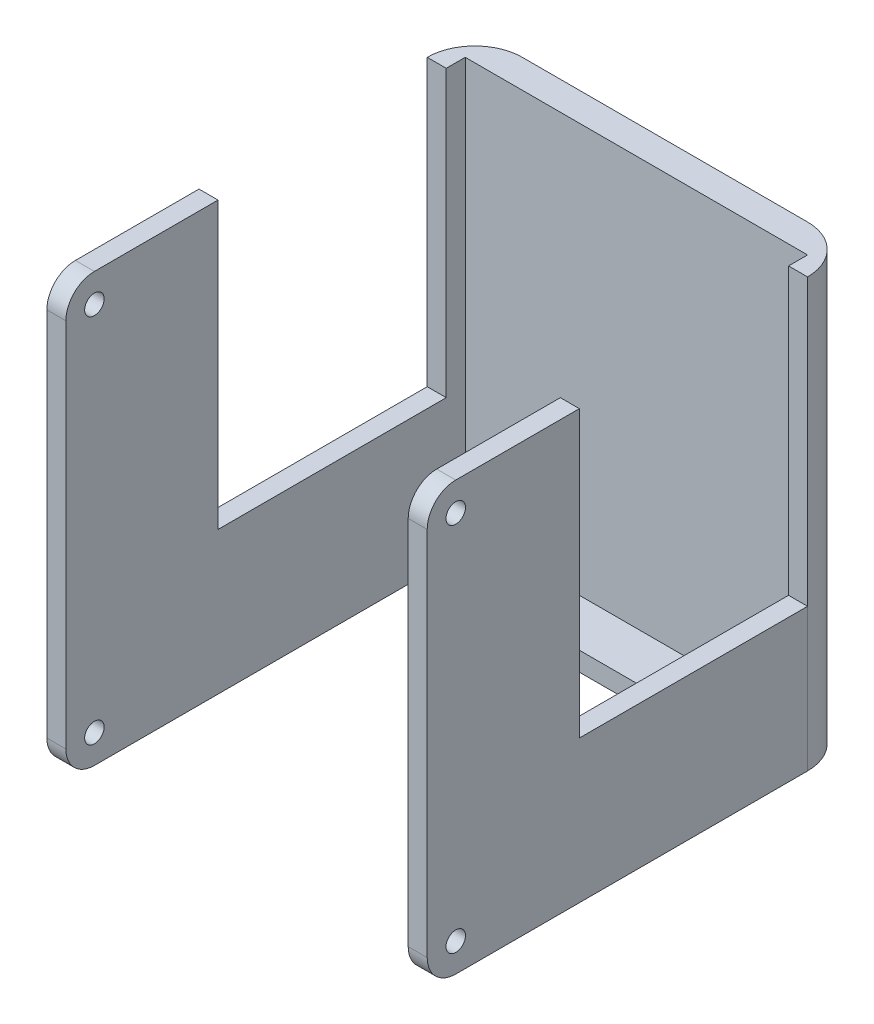
ISO-10303-21;
HEADER;
FILE_DESCRIPTION(('STEP AP214'),'2;1');
FILE_NAME('part.step','',(''),(''),'','','');
FILE_SCHEMA(('AUTOMOTIVE_DESIGN { 1 0 10303 214 1 1 1 1 }'));
ENDSEC;
DATA;
#1=APPLICATION_CONTEXT('core data for automotive mechanical design processes');
#2=APPLICATION_PROTOCOL_DEFINITION('international standard','automotive_design',2000,#1);
#3=PRODUCT_CONTEXT('',#1,'mechanical');
#4=PRODUCT('Part','Part','',(#3));
#5=PRODUCT_RELATED_PRODUCT_CATEGORY('part','',(#4));
#6=PRODUCT_DEFINITION_FORMATION('','',#4);
#7=PRODUCT_DEFINITION_CONTEXT('part definition',#1,'design');
#8=PRODUCT_DEFINITION('design','',#6,#7);
#9=PRODUCT_DEFINITION_SHAPE('','',#8);
#10=(LENGTH_UNIT() NAMED_UNIT(*) SI_UNIT(.MILLI.,.METRE.));
#11=(NAMED_UNIT(*) PLANE_ANGLE_UNIT() SI_UNIT($,.RADIAN.));
#12=(NAMED_UNIT(*) SI_UNIT($,.STERADIAN.) SOLID_ANGLE_UNIT());
#13=UNCERTAINTY_MEASURE_WITH_UNIT(LENGTH_MEASURE(1.E-05),#10,'distance_accuracy_value','');
#14=(GEOMETRIC_REPRESENTATION_CONTEXT(3) GLOBAL_UNCERTAINTY_ASSIGNED_CONTEXT((#13)) GLOBAL_UNIT_ASSIGNED_CONTEXT((#10,
#11,#12)) REPRESENTATION_CONTEXT('',''));
#15=CARTESIAN_POINT('',(0.,0.,0.));
#16=DIRECTION('',(0.,0.,1.));
#17=DIRECTION('',(1.,0.,0.));
#18=AXIS2_PLACEMENT_3D('',#15,#16,#17);
#19=CARTESIAN_POINT('',(-14.5454545454545,16.9090909090909,-5.));
#20=DIRECTION('',(0.,-1.,0.));
#21=DIRECTION('',(0.,0.,-1.));
#22=AXIS2_PLACEMENT_3D('',#19,#20,#21);
#23=PLANE('',#22);
#24=CARTESIAN_POINT('',(-9.54545454545454,16.9090909090909,0.));
#25=DIRECTION('',(0.,-1.,0.));
#26=DIRECTION('',(0.,0.,-1.));
#27=AXIS2_PLACEMENT_3D('',#24,#25,#26);
#28=CIRCLE('',#27,5.);
#29=CARTESIAN_POINT('',(-9.54545454545455,16.9090909090909,-5.));
#30=VERTEX_POINT('',#29);
#31=CARTESIAN_POINT('',(-14.5454545454545,16.9090909090909,0.));
#32=VERTEX_POINT('',#31);
#33=EDGE_CURVE('E238',#30,#32,#28,.F.);
#34=ORIENTED_EDGE('',*,*,#33,.T.);
#35=DIRECTION('',(-1.,0.,0.));
#36=VECTOR('',#35,1.);
#37=CARTESIAN_POINT('',(29.4545454545455,16.9090909090909,0.));
#38=LINE('',#37,#36);
#39=CARTESIAN_POINT('',(-12.5454545454545,16.9090909090909,0.));
#40=VERTEX_POINT('',#39);
#41=EDGE_CURVE('E209',#40,#32,#38,.T.);
#42=ORIENTED_EDGE('',*,*,#41,.F.);
#43=DIRECTION('',(0.,0.,1.));
#44=VECTOR('',#43,1.);
#45=CARTESIAN_POINT('',(-12.5454545454545,16.9090909090909,3.));
#46=LINE('',#45,#44);
#47=CARTESIAN_POINT('',(-12.5454545454545,16.9090909090909,-2.));
#48=VERTEX_POINT('',#47);
#49=EDGE_CURVE('E428',#48,#40,#46,.T.);
#50=ORIENTED_EDGE('',*,*,#49,.F.);
#51=DIRECTION('',(-1.,0.,0.));
#52=VECTOR('',#51,1.);
#53=CARTESIAN_POINT('',(-12.5454545454545,16.9090909090909,-2.));
#54=LINE('',#53,#52);
#55=CARTESIAN_POINT('',(23.4545454545454,16.9090909090909,-2.));
#56=VERTEX_POINT('',#55);
#57=EDGE_CURVE('E369',#56,#48,#54,.T.);
#58=ORIENTED_EDGE('',*,*,#57,.F.);
#59=DIRECTION('',(0.,0.,-1.));
#60=VECTOR('',#59,1.);
#61=CARTESIAN_POINT('',(23.4545454545455,16.9090909090909,3.));
#62=LINE('',#61,#60);
#63=CARTESIAN_POINT('',(23.4545454545455,16.9090909090909,0.));
#64=VERTEX_POINT('',#63);
#65=EDGE_CURVE('E432',#64,#56,#62,.T.);
#66=ORIENTED_EDGE('',*,*,#65,.F.);
#67=CARTESIAN_POINT('',(25.4545454545455,16.9090909090909,0.));
#68=VERTEX_POINT('',#67);
#69=EDGE_CURVE('E342',#68,#64,#38,.T.);
#70=ORIENTED_EDGE('',*,*,#69,.F.);
#71=CARTESIAN_POINT('',(20.4545454545455,16.9090909090909,0.));
#72=DIRECTION('',(0.,-1.,0.));
#73=DIRECTION('',(0.,0.,-1.));
#74=AXIS2_PLACEMENT_3D('',#71,#72,#73);
#75=CIRCLE('',#74,5.);
#76=CARTESIAN_POINT('',(20.4545454545455,16.9090909090909,-5.));
#77=VERTEX_POINT('',#76);
#78=EDGE_CURVE('E249',#68,#77,#75,.F.);
#79=ORIENTED_EDGE('',*,*,#78,.T.);
#80=DIRECTION('',(1.,0.,0.));
#81=VECTOR('',#80,1.);
#82=CARTESIAN_POINT('',(-14.5454545454545,16.9090909090909,-5.));
#83=LINE('',#82,#81);
#84=EDGE_CURVE('E456',#30,#77,#83,.T.);
#85=ORIENTED_EDGE('',*,*,#84,.F.);
#86=EDGE_LOOP('',(#34,#42,#50,#58,#66,#70,#79,#85));
#87=FACE_BOUND('',#86,.T.);
#88=ADVANCED_FACE('F38',(#87),#23,.F.);
#89=DIRECTION('',(0.,0.,1.));
#90=VECTOR('',#89,1.);
#91=CARTESIAN_POINT('',(25.4545454545455,16.9090909090909,-5.));
#92=LINE('',#91,#90);
#93=CARTESIAN_POINT('',(25.4545454545455,16.9090909090909,24.));
#94=VERTEX_POINT('',#93);
#95=CARTESIAN_POINT('',(25.4545454545455,16.9090909090909,37.));
#96=VERTEX_POINT('',#95);
#97=EDGE_CURVE('E336',#94,#96,#92,.T.);
#98=ORIENTED_EDGE('',*,*,#97,.F.);
#99=DIRECTION('',(-1.,0.,0.));
#100=VECTOR('',#99,1.);
#101=CARTESIAN_POINT('',(29.4545454545455,16.9090909090909,24.));
#102=LINE('',#101,#100);
#103=CARTESIAN_POINT('',(23.4545454545455,16.9090909090909,24.));
#104=VERTEX_POINT('',#103);
#105=EDGE_CURVE('E329',#94,#104,#102,.T.);
#106=ORIENTED_EDGE('',*,*,#105,.T.);
#107=CARTESIAN_POINT('',(23.4545454545455,16.9090909090909,37.));
#108=VERTEX_POINT('',#107);
#109=EDGE_CURVE('E324',#108,#104,#62,.T.);
#110=ORIENTED_EDGE('',*,*,#109,.F.);
#111=DIRECTION('',(1.,0.,0.));
#112=VECTOR('',#111,1.);
#113=CARTESIAN_POINT('',(-14.5454545454545,16.9090909090909,37.));
#114=LINE('',#113,#112);
#115=EDGE_CURVE('E301',#108,#96,#114,.T.);
#116=ORIENTED_EDGE('',*,*,#115,.T.);
#117=EDGE_LOOP('',(#98,#106,#110,#116));
#118=FACE_BOUND('',#117,.T.);
#119=ADVANCED_FACE('F335',(#118),#23,.F.);
#120=CARTESIAN_POINT('',(-14.5454545454545,13.9090909090909,37.));
#121=DIRECTION('',(1.,0.,0.));
#122=DIRECTION('',(0.,0.,-1.));
#123=AXIS2_PLACEMENT_3D('',#120,#121,#122);
#124=CYLINDRICAL_SURFACE('',#123,3.);
#125=ORIENTED_EDGE('',*,*,#115,.F.);
#126=CARTESIAN_POINT('',(23.4545454545455,13.9090909090909,37.));
#127=DIRECTION('',(1.,0.,0.));
#128=DIRECTION('',(0.,0.,-1.));
#129=AXIS2_PLACEMENT_3D('',#126,#127,#128);
#130=CIRCLE('',#129,3.);
#131=CARTESIAN_POINT('',(23.4545454545455,13.9090909090909,40.));
#132=VERTEX_POINT('',#131);
#133=EDGE_CURVE('E309',#132,#108,#130,.F.);
#134=ORIENTED_EDGE('',*,*,#133,.F.);
#135=DIRECTION('',(1.,0.,0.));
#136=VECTOR('',#135,1.);
#137=CARTESIAN_POINT('',(0.,13.9090909090909,40.));
#138=LINE('',#137,#136);
#139=CARTESIAN_POINT('',(25.4545454545455,13.9090909090909,40.));
#140=VERTEX_POINT('',#139);
#141=EDGE_CURVE('E305',#140,#132,#138,.F.);
#142=ORIENTED_EDGE('',*,*,#141,.F.);
#143=CARTESIAN_POINT('',(25.4545454545455,13.9090909090909,37.));
#144=DIRECTION('',(-1.,0.,0.));
#145=DIRECTION('',(0.,-1.,0.));
#146=AXIS2_PLACEMENT_3D('',#143,#144,#145);
#147=CIRCLE('',#146,3.);
#148=EDGE_CURVE('E312',#96,#140,#147,.F.);
#149=ORIENTED_EDGE('',*,*,#148,.F.);
#150=EDGE_LOOP('',(#125,#134,#142,#149));
#151=FACE_BOUND('',#150,.T.);
#152=ADVANCED_FACE('F40',(#151),#124,.T.);
#153=CARTESIAN_POINT('',(-14.5454545454545,13.9090909090909,37.));
#154=DIRECTION('',(1.,0.,0.));
#155=DIRECTION('',(0.,0.,-1.));
#156=AXIS2_PLACEMENT_3D('',#153,#154,#155);
#157=CYLINDRICAL_SURFACE('',#156,3.);
#158=DIRECTION('',(1.,0.,0.));
#159=VECTOR('',#158,1.);
#160=CARTESIAN_POINT('',(-14.5454545454545,16.9090909090909,37.));
#161=LINE('',#160,#159);
#162=CARTESIAN_POINT('',(-14.5454545454545,16.9090909090909,37.));
#163=VERTEX_POINT('',#162);
#164=CARTESIAN_POINT('',(-12.5454545454545,16.9090909090909,37.));
#165=VERTEX_POINT('',#164);
#166=EDGE_CURVE('E285',#163,#165,#161,.T.);
#167=ORIENTED_EDGE('',*,*,#166,.F.);
#168=CARTESIAN_POINT('',(-14.5454545454545,13.9090909090909,37.));
#169=DIRECTION('',(-1.,0.,0.));
#170=DIRECTION('',(0.,-1.,0.));
#171=AXIS2_PLACEMENT_3D('',#168,#169,#170);
#172=CIRCLE('',#171,3.);
#173=CARTESIAN_POINT('',(-14.5454545454545,13.9090909090909,40.));
#174=VERTEX_POINT('',#173);
#175=EDGE_CURVE('E297',#174,#163,#172,.T.);
#176=ORIENTED_EDGE('',*,*,#175,.F.);
#177=DIRECTION('',(1.,0.,0.));
#178=VECTOR('',#177,1.);
#179=CARTESIAN_POINT('',(0.,13.9090909090909,40.));
#180=LINE('',#179,#178);
#181=CARTESIAN_POINT('',(-12.5454545454545,13.9090909090909,40.));
#182=VERTEX_POINT('',#181);
#183=EDGE_CURVE('E293',#182,#174,#180,.F.);
#184=ORIENTED_EDGE('',*,*,#183,.F.);
#185=CARTESIAN_POINT('',(-12.5454545454545,13.9090909090909,37.));
#186=DIRECTION('',(-1.,0.,0.));
#187=DIRECTION('',(0.,0.,1.));
#188=AXIS2_PLACEMENT_3D('',#185,#186,#187);
#189=CIRCLE('',#188,3.);
#190=EDGE_CURVE('E289',#165,#182,#189,.F.);
#191=ORIENTED_EDGE('',*,*,#190,.F.);
#192=EDGE_LOOP('',(#167,#176,#184,#191));
#193=FACE_BOUND('',#192,.T.);
#194=ADVANCED_FACE('F523',(#193),#157,.T.);
#195=CARTESIAN_POINT('',(-14.5454545454545,-25.0909090909091,37.));
#196=DIRECTION('',(1.,0.,0.));
#197=DIRECTION('',(0.,0.,-1.));
#198=AXIS2_PLACEMENT_3D('',#195,#196,#197);
#199=CYLINDRICAL_SURFACE('',#198,3.);
#200=DIRECTION('',(-1.,0.,0.));
#201=VECTOR('',#200,1.);
#202=CARTESIAN_POINT('',(-14.5454545454545,-28.0909090909091,37.));
#203=LINE('',#202,#201);
#204=CARTESIAN_POINT('',(25.4545454545455,-28.0909090909091,37.));
#205=VERTEX_POINT('',#204);
#206=CARTESIAN_POINT('',(23.4545454545455,-28.0909090909091,37.));
#207=VERTEX_POINT('',#206);
#208=EDGE_CURVE('E270',#205,#207,#203,.T.);
#209=ORIENTED_EDGE('',*,*,#208,.F.);
#210=CARTESIAN_POINT('',(25.4545454545455,-25.0909090909091,37.));
#211=DIRECTION('',(-1.,0.,0.));
#212=DIRECTION('',(0.,-1.,0.));
#213=AXIS2_PLACEMENT_3D('',#210,#211,#212);
#214=CIRCLE('',#213,3.);
#215=CARTESIAN_POINT('',(25.4545454545455,-25.0909090909091,40.));
#216=VERTEX_POINT('',#215);
#217=EDGE_CURVE('E278',#216,#205,#214,.F.);
#218=ORIENTED_EDGE('',*,*,#217,.F.);
#219=DIRECTION('',(-1.,0.,0.));
#220=VECTOR('',#219,1.);
#221=CARTESIAN_POINT('',(-14.5454545454545,-25.0909090909091,40.));
#222=LINE('',#221,#220);
#223=CARTESIAN_POINT('',(23.4545454545455,-25.0909090909091,40.));
#224=VERTEX_POINT('',#223);
#225=EDGE_CURVE('E274',#224,#216,#222,.F.);
#226=ORIENTED_EDGE('',*,*,#225,.F.);
#227=CARTESIAN_POINT('',(23.4545454545455,-25.0909090909091,37.));
#228=DIRECTION('',(1.,0.,0.));
#229=DIRECTION('',(0.,0.,-1.));
#230=AXIS2_PLACEMENT_3D('',#227,#228,#229);
#231=CIRCLE('',#230,3.);
#232=EDGE_CURVE('E281',#207,#224,#231,.F.);
#233=ORIENTED_EDGE('',*,*,#232,.F.);
#234=EDGE_LOOP('',(#209,#218,#226,#233));
#235=FACE_BOUND('',#234,.T.);
#236=ADVANCED_FACE('F498',(#235),#199,.T.);
#237=CARTESIAN_POINT('',(-14.5454545454545,-25.0909090909091,37.));
#238=DIRECTION('',(1.,0.,0.));
#239=DIRECTION('',(0.,0.,-1.));
#240=AXIS2_PLACEMENT_3D('',#237,#238,#239);
#241=CYLINDRICAL_SURFACE('',#240,3.);
#242=DIRECTION('',(-1.,0.,0.));
#243=VECTOR('',#242,1.);
#244=CARTESIAN_POINT('',(-14.5454545454545,-28.0909090909091,37.));
#245=LINE('',#244,#243);
#246=CARTESIAN_POINT('',(-12.5454545454545,-28.0909090909091,37.));
#247=VERTEX_POINT('',#246);
#248=CARTESIAN_POINT('',(-14.5454545454545,-28.0909090909091,37.));
#249=VERTEX_POINT('',#248);
#250=EDGE_CURVE('E255',#247,#249,#245,.T.);
#251=ORIENTED_EDGE('',*,*,#250,.F.);
#252=CARTESIAN_POINT('',(-12.5454545454545,-25.0909090909091,37.));
#253=DIRECTION('',(-1.,0.,0.));
#254=DIRECTION('',(0.,0.,1.));
#255=AXIS2_PLACEMENT_3D('',#252,#253,#254);
#256=CIRCLE('',#255,3.);
#257=CARTESIAN_POINT('',(-12.5454545454545,-25.0909090909091,40.));
#258=VERTEX_POINT('',#257);
#259=EDGE_CURVE('E263',#258,#247,#256,.F.);
#260=ORIENTED_EDGE('',*,*,#259,.F.);
#261=DIRECTION('',(-1.,0.,0.));
#262=VECTOR('',#261,1.);
#263=CARTESIAN_POINT('',(-14.5454545454545,-25.0909090909091,40.));
#264=LINE('',#263,#262);
#265=CARTESIAN_POINT('',(-14.5454545454545,-25.0909090909091,40.));
#266=VERTEX_POINT('',#265);
#267=EDGE_CURVE('E259',#266,#258,#264,.F.);
#268=ORIENTED_EDGE('',*,*,#267,.F.);
#269=CARTESIAN_POINT('',(-14.5454545454545,-25.0909090909091,37.));
#270=DIRECTION('',(-1.,0.,0.));
#271=DIRECTION('',(0.,-1.,0.));
#272=AXIS2_PLACEMENT_3D('',#269,#270,#271);
#273=CIRCLE('',#272,3.);
#274=EDGE_CURVE('E266',#249,#266,#273,.T.);
#275=ORIENTED_EDGE('',*,*,#274,.F.);
#276=EDGE_LOOP('',(#251,#260,#268,#275));
#277=FACE_BOUND('',#276,.T.);
#278=ADVANCED_FACE('F533',(#277),#241,.T.);
#279=CARTESIAN_POINT('',(20.4545454545455,0.,0.));
#280=DIRECTION('',(0.,1.,0.));
#281=DIRECTION('',(-1.,0.,0.));
#282=AXIS2_PLACEMENT_3D('',#279,#280,#281);
#283=CYLINDRICAL_SURFACE('',#282,5.);
#284=DIRECTION('',(0.,-1.,0.));
#285=VECTOR('',#284,1.);
#286=CARTESIAN_POINT('',(20.4545454545455,0.,-5.));
#287=LINE('',#286,#285);
#288=CARTESIAN_POINT('',(20.4545454545455,-28.0909090909091,-5.));
#289=VERTEX_POINT('',#288);
#290=EDGE_CURVE('E241',#77,#289,#287,.T.);
#291=ORIENTED_EDGE('',*,*,#290,.F.);
#292=ORIENTED_EDGE('',*,*,#78,.F.);
#293=DIRECTION('',(0.,-1.,0.));
#294=VECTOR('',#293,1.);
#295=CARTESIAN_POINT('',(25.4545454545455,16.9090909090909,0.));
#296=LINE('',#295,#294);
#297=CARTESIAN_POINT('',(25.4545454545455,-13.0909090909091,0.));
#298=VERTEX_POINT('',#297);
#299=EDGE_CURVE('E365',#68,#298,#296,.T.);
#300=ORIENTED_EDGE('',*,*,#299,.T.);
#301=DIRECTION('',(0.,-1.,0.));
#302=VECTOR('',#301,1.);
#303=CARTESIAN_POINT('',(25.4545454545455,0.,0.));
#304=LINE('',#303,#302);
#305=CARTESIAN_POINT('',(25.4545454545455,-28.0909090909091,0.));
#306=VERTEX_POINT('',#305);
#307=EDGE_CURVE('E245',#306,#298,#304,.F.);
#308=ORIENTED_EDGE('',*,*,#307,.F.);
#309=CARTESIAN_POINT('',(20.4545454545455,-28.0909090909091,0.));
#310=DIRECTION('',(0.,-1.,0.));
#311=DIRECTION('',(0.,0.,-1.));
#312=AXIS2_PLACEMENT_3D('',#309,#310,#311);
#313=CIRCLE('',#312,5.);
#314=EDGE_CURVE('E252',#289,#306,#313,.T.);
#315=ORIENTED_EDGE('',*,*,#314,.F.);
#316=EDGE_LOOP('',(#291,#292,#300,#308,#315));
#317=FACE_BOUND('',#316,.T.);
#318=ADVANCED_FACE('F542',(#317),#283,.T.);
#319=CARTESIAN_POINT('',(-9.54545454545454,0.,0.));
#320=DIRECTION('',(0.,1.,0.));
#321=DIRECTION('',(-1.,0.,0.));
#322=AXIS2_PLACEMENT_3D('',#319,#320,#321);
#323=CYLINDRICAL_SURFACE('',#322,5.);
#324=DIRECTION('',(0.,1.,0.));
#325=VECTOR('',#324,1.);
#326=CARTESIAN_POINT('',(-9.54545454545454,0.,-5.));
#327=LINE('',#326,#325);
#328=CARTESIAN_POINT('',(-9.54545454545454,-28.0909090909091,-5.));
#329=VERTEX_POINT('',#328);
#330=EDGE_CURVE('E229',#329,#30,#327,.T.);
#331=ORIENTED_EDGE('',*,*,#330,.F.);
#332=CARTESIAN_POINT('',(-9.54545454545454,-28.0909090909091,0.));
#333=DIRECTION('',(0.,-1.,0.));
#334=DIRECTION('',(0.,0.,-1.));
#335=AXIS2_PLACEMENT_3D('',#332,#333,#334);
#336=CIRCLE('',#335,5.);
#337=CARTESIAN_POINT('',(-14.5454545454545,-28.0909090909091,0.));
#338=VERTEX_POINT('',#337);
#339=EDGE_CURVE('E214',#338,#329,#336,.T.);
#340=ORIENTED_EDGE('',*,*,#339,.F.);
#341=DIRECTION('',(0.,1.,0.));
#342=VECTOR('',#341,1.);
#343=CARTESIAN_POINT('',(-14.5454545454545,16.9090909090909,0.));
#344=LINE('',#343,#342);
#345=CARTESIAN_POINT('',(-14.5454545454545,-13.0909090909091,0.));
#346=VERTEX_POINT('',#345);
#347=EDGE_CURVE('E215',#346,#338,#344,.F.);
#348=ORIENTED_EDGE('',*,*,#347,.F.);
#349=EDGE_CURVE('E206',#32,#346,#344,.F.);
#350=ORIENTED_EDGE('',*,*,#349,.F.);
#351=ORIENTED_EDGE('',*,*,#33,.F.);
#352=EDGE_LOOP('',(#331,#340,#348,#350,#351));
#353=FACE_BOUND('',#352,.T.);
#354=ADVANCED_FACE('F226',(#353),#323,.T.);
#355=CARTESIAN_POINT('',(0.,0.,40.));
#356=DIRECTION('',(0.,0.,-1.));
#357=DIRECTION('',(-1.,0.,0.));
#358=AXIS2_PLACEMENT_3D('',#355,#356,#357);
#359=PLANE('',#358);
#360=DIRECTION('',(0.,1.,0.));
#361=VECTOR('',#360,1.);
#362=CARTESIAN_POINT('',(-12.5454545454545,0.,40.));
#363=LINE('',#362,#361);
#364=EDGE_CURVE('E479',#258,#182,#363,.T.);
#365=ORIENTED_EDGE('',*,*,#364,.T.);
#366=ORIENTED_EDGE('',*,*,#183,.T.);
#367=DIRECTION('',(0.,-1.,0.));
#368=VECTOR('',#367,1.);
#369=CARTESIAN_POINT('',(-14.5454545454545,16.9090909090909,40.));
#370=LINE('',#369,#368);
#371=EDGE_CURVE('E453',#174,#266,#370,.T.);
#372=ORIENTED_EDGE('',*,*,#371,.T.);
#373=ORIENTED_EDGE('',*,*,#267,.T.);
#374=EDGE_LOOP('',(#365,#366,#372,#373));
#375=FACE_BOUND('',#374,.T.);
#376=ADVANCED_FACE('F529',(#375),#359,.F.);
#377=CARTESIAN_POINT('',(-12.5454545454545,16.9090909090909,24.));
#378=VERTEX_POINT('',#377);
#379=EDGE_CURVE('E416',#378,#165,#46,.T.);
#380=ORIENTED_EDGE('',*,*,#379,.F.);
#381=CARTESIAN_POINT('',(-14.5454545454545,16.9090909090909,24.));
#382=VERTEX_POINT('',#381);
#383=EDGE_CURVE('E338',#378,#382,#102,.T.);
#384=ORIENTED_EDGE('',*,*,#383,.T.);
#385=DIRECTION('',(0.,0.,1.));
#386=VECTOR('',#385,1.);
#387=CARTESIAN_POINT('',(-14.5454545454545,16.9090909090909,-5.));
#388=LINE('',#387,#386);
#389=EDGE_CURVE('E464',#382,#163,#388,.T.);
#390=ORIENTED_EDGE('',*,*,#389,.T.);
#391=ORIENTED_EDGE('',*,*,#166,.T.);
#392=EDGE_LOOP('',(#380,#384,#390,#391));
#393=FACE_BOUND('',#392,.T.);
#394=ADVANCED_FACE('F518',(#393),#23,.F.);
#395=CARTESIAN_POINT('',(25.4545454545455,16.9090909090909,-5.));
#396=DIRECTION('',(-1.,0.,0.));
#397=DIRECTION('',(0.,-1.,0.));
#398=AXIS2_PLACEMENT_3D('',#395,#396,#397);
#399=PLANE('',#398);
#400=CARTESIAN_POINT('',(25.4545454545455,13.9090909090909,37.));
#401=DIRECTION('',(1.,0.,0.));
#402=DIRECTION('',(0.,1.,0.));
#403=AXIS2_PLACEMENT_3D('',#400,#401,#402);
#404=CIRCLE('',#403,1.025);
#405=CARTESIAN_POINT('',(25.4545454545455,14.9340909090909,37.));
#406=VERTEX_POINT('',#405);
#407=EDGE_CURVE('E401',#406,#406,#404,.T.);
#408=ORIENTED_EDGE('',*,*,#407,.F.);
#409=EDGE_LOOP('',(#408));
#410=FACE_BOUND('',#409,.T.);
#411=CARTESIAN_POINT('',(25.4545454545455,-25.0909090909091,37.));
#412=DIRECTION('',(1.,0.,0.));
#413=DIRECTION('',(0.,1.,0.));
#414=AXIS2_PLACEMENT_3D('',#411,#412,#413);
#415=CIRCLE('',#414,1.025);
#416=CARTESIAN_POINT('',(25.4545454545455,-24.0659090909091,37.));
#417=VERTEX_POINT('',#416);
#418=EDGE_CURVE('E392',#417,#417,#415,.T.);
#419=ORIENTED_EDGE('',*,*,#418,.F.);
#420=EDGE_LOOP('',(#419));
#421=FACE_BOUND('',#420,.T.);
#422=DIRECTION('',(0.,0.,1.));
#423=VECTOR('',#422,1.);
#424=CARTESIAN_POINT('',(25.4545454545455,-13.0909090909091,-5.));
#425=LINE('',#424,#423);
#426=CARTESIAN_POINT('',(25.4545454545455,-13.0909090909091,24.));
#427=VERTEX_POINT('',#426);
#428=EDGE_CURVE('E351',#298,#427,#425,.T.);
#429=ORIENTED_EDGE('',*,*,#428,.T.);
#430=DIRECTION('',(0.,1.,0.));
#431=VECTOR('',#430,1.);
#432=CARTESIAN_POINT('',(25.4545454545455,16.9090909090909,24.));
#433=LINE('',#432,#431);
#434=EDGE_CURVE('E359',#427,#94,#433,.T.);
#435=ORIENTED_EDGE('',*,*,#434,.T.);
#436=ORIENTED_EDGE('',*,*,#97,.T.);
#437=ORIENTED_EDGE('',*,*,#148,.T.);
#438=DIRECTION('',(0.,-1.,0.));
#439=VECTOR('',#438,1.);
#440=CARTESIAN_POINT('',(25.4545454545455,16.9090909090909,40.));
#441=LINE('',#440,#439);
#442=EDGE_CURVE('E450',#140,#216,#441,.T.);
#443=ORIENTED_EDGE('',*,*,#442,.T.);
#444=ORIENTED_EDGE('',*,*,#217,.T.);
#445=DIRECTION('',(0.,0.,1.));
#446=VECTOR('',#445,1.);
#447=CARTESIAN_POINT('',(25.4545454545455,-28.0909090909091,-5.));
#448=LINE('',#447,#446);
#449=EDGE_CURVE('E470',#306,#205,#448,.T.);
#450=ORIENTED_EDGE('',*,*,#449,.F.);
#451=ORIENTED_EDGE('',*,*,#307,.T.);
#452=EDGE_LOOP('',(#429,#435,#436,#437,#443,#444,#450,#451));
#453=FACE_BOUND('',#452,.T.);
#454=ADVANCED_FACE('F509',(#410,#421,#453),#399,.F.);
#455=CARTESIAN_POINT('',(-14.5454545454545,-28.0909090909091,-5.));
#456=DIRECTION('',(0.,-1.,0.));
#457=DIRECTION('',(0.,0.,-1.));
#458=AXIS2_PLACEMENT_3D('',#455,#456,#457);
#459=PLANE('',#458);
#460=ORIENTED_EDGE('',*,*,#449,.T.);
#461=ORIENTED_EDGE('',*,*,#208,.T.);
#462=DIRECTION('',(0.,0.,1.));
#463=VECTOR('',#462,1.);
#464=CARTESIAN_POINT('',(23.4545454545455,-28.0909090909091,-5.00000000000001));
#465=LINE('',#464,#463);
#466=CARTESIAN_POINT('',(23.4545454545455,-28.0909090909091,3.));
#467=VERTEX_POINT('',#466);
#468=EDGE_CURVE('E440',#467,#207,#465,.T.);
#469=ORIENTED_EDGE('',*,*,#468,.F.);
#470=DIRECTION('',(1.,0.,0.));
#471=VECTOR('',#470,1.);
#472=CARTESIAN_POINT('',(-14.5454545454545,-28.0909090909091,3.));
#473=LINE('',#472,#471);
#474=CARTESIAN_POINT('',(-12.5454545454545,-28.0909090909091,3.));
#475=VERTEX_POINT('',#474);
#476=EDGE_CURVE('E232',#475,#467,#473,.T.);
#477=ORIENTED_EDGE('',*,*,#476,.F.);
#478=DIRECTION('',(0.,0.,-1.));
#479=VECTOR('',#478,1.);
#480=CARTESIAN_POINT('',(-12.5454545454545,-28.0909090909091,-5.));
#481=LINE('',#480,#479);
#482=EDGE_CURVE('E447',#247,#475,#481,.T.);
#483=ORIENTED_EDGE('',*,*,#482,.F.);
#484=ORIENTED_EDGE('',*,*,#250,.T.);
#485=DIRECTION('',(0.,0.,1.));
#486=VECTOR('',#485,1.);
#487=CARTESIAN_POINT('',(-14.5454545454545,-28.0909090909091,-5.));
#488=LINE('',#487,#486);
#489=EDGE_CURVE('E467',#338,#249,#488,.T.);
#490=ORIENTED_EDGE('',*,*,#489,.F.);
#491=ORIENTED_EDGE('',*,*,#339,.T.);
#492=DIRECTION('',(1.,0.,0.));
#493=VECTOR('',#492,1.);
#494=CARTESIAN_POINT('',(-14.5454545454545,-28.0909090909091,-5.));
#495=LINE('',#494,#493);
#496=EDGE_CURVE('E460',#329,#289,#495,.T.);
#497=ORIENTED_EDGE('',*,*,#496,.T.);
#498=ORIENTED_EDGE('',*,*,#314,.T.);
#499=EDGE_LOOP('',(#460,#461,#469,#477,#483,#484,#490,#491,#497,#498));
#500=FACE_BOUND('',#499,.T.);
#501=ADVANCED_FACE('F493',(#500),#459,.T.);
#502=CARTESIAN_POINT('',(-14.5454545454545,16.9090909090909,-5.));
#503=DIRECTION('',(-1.,0.,0.));
#504=DIRECTION('',(0.,-1.,0.));
#505=AXIS2_PLACEMENT_3D('',#502,#503,#504);
#506=PLANE('',#505);
#507=DIRECTION('',(0.,1.,0.));
#508=VECTOR('',#507,1.);
#509=CARTESIAN_POINT('',(-14.5454545454545,-13.0909090909091,24.));
#510=LINE('',#509,#508);
#511=CARTESIAN_POINT('',(-14.5454545454545,-13.0909090909091,24.));
#512=VERTEX_POINT('',#511);
#513=EDGE_CURVE('E203',#512,#382,#510,.T.);
#514=ORIENTED_EDGE('',*,*,#513,.F.);
#515=DIRECTION('',(0.,0.,1.));
#516=VECTOR('',#515,1.);
#517=CARTESIAN_POINT('',(-14.5454545454545,-13.0909090909091,0.));
#518=LINE('',#517,#516);
#519=EDGE_CURVE('E196',#346,#512,#518,.T.);
#520=ORIENTED_EDGE('',*,*,#519,.F.);
#521=ORIENTED_EDGE('',*,*,#347,.T.);
#522=ORIENTED_EDGE('',*,*,#489,.T.);
#523=ORIENTED_EDGE('',*,*,#274,.T.);
#524=ORIENTED_EDGE('',*,*,#371,.F.);
#525=ORIENTED_EDGE('',*,*,#175,.T.);
#526=ORIENTED_EDGE('',*,*,#389,.F.);
#527=EDGE_LOOP('',(#514,#520,#521,#522,#523,#524,#525,#526));
#528=FACE_BOUND('',#527,.T.);
#529=CARTESIAN_POINT('',(-14.5454545454545,13.9090909090909,37.));
#530=DIRECTION('',(-1.,0.,0.));
#531=DIRECTION('',(0.,-1.,0.));
#532=AXIS2_PLACEMENT_3D('',#529,#530,#531);
#533=CIRCLE('',#532,1.025);
#534=CARTESIAN_POINT('',(-14.5454545454545,12.8840909090909,37.));
#535=VERTEX_POINT('',#534);
#536=EDGE_CURVE('E417',#535,#535,#533,.T.);
#537=ORIENTED_EDGE('',*,*,#536,.F.);
#538=EDGE_LOOP('',(#537));
#539=FACE_BOUND('',#538,.T.);
#540=CARTESIAN_POINT('',(-14.5454545454545,-25.0909090909091,37.));
#541=DIRECTION('',(-1.,0.,0.));
#542=DIRECTION('',(0.,-1.,0.));
#543=AXIS2_PLACEMENT_3D('',#540,#541,#542);
#544=CIRCLE('',#543,1.025);
#545=CARTESIAN_POINT('',(-14.5454545454545,-26.1159090909091,37.));
#546=VERTEX_POINT('',#545);
#547=EDGE_CURVE('E400',#546,#546,#544,.T.);
#548=ORIENTED_EDGE('',*,*,#547,.F.);
#549=EDGE_LOOP('',(#548));
#550=FACE_BOUND('',#549,.T.);
#551=ADVANCED_FACE('F218',(#528,#539,#550),#506,.T.);
#552=CARTESIAN_POINT('',(0.,0.,-5.));
#553=DIRECTION('',(0.,0.,-1.));
#554=DIRECTION('',(-1.,0.,0.));
#555=AXIS2_PLACEMENT_3D('',#552,#553,#554);
#556=PLANE('',#555);
#557=ORIENTED_EDGE('',*,*,#84,.T.);
#558=ORIENTED_EDGE('',*,*,#290,.T.);
#559=ORIENTED_EDGE('',*,*,#496,.F.);
#560=ORIENTED_EDGE('',*,*,#330,.T.);
#561=EDGE_LOOP('',(#557,#558,#559,#560));
#562=FACE_BOUND('',#561,.T.);
#563=ADVANCED_FACE('F538',(#562),#556,.T.);
#564=ORIENTED_EDGE('',*,*,#442,.F.);
#565=ORIENTED_EDGE('',*,*,#141,.T.);
#566=DIRECTION('',(0.,-1.,0.));
#567=VECTOR('',#566,1.);
#568=CARTESIAN_POINT('',(23.4545454545455,0.,40.));
#569=LINE('',#568,#567);
#570=EDGE_CURVE('E476',#132,#224,#569,.T.);
#571=ORIENTED_EDGE('',*,*,#570,.T.);
#572=ORIENTED_EDGE('',*,*,#225,.T.);
#573=EDGE_LOOP('',(#564,#565,#571,#572));
#574=FACE_BOUND('',#573,.T.);
#575=ADVANCED_FACE('F504',(#574),#359,.F.);
#576=CARTESIAN_POINT('',(-12.5454545454545,-33.0909090909091,3.));
#577=DIRECTION('',(-1.,0.,0.));
#578=DIRECTION('',(0.,0.,1.));
#579=AXIS2_PLACEMENT_3D('',#576,#577,#578);
#580=PLANE('',#579);
#581=ORIENTED_EDGE('',*,*,#49,.T.);
#582=DIRECTION('',(0.,-1.,0.));
#583=VECTOR('',#582,1.);
#584=CARTESIAN_POINT('',(-12.5454545454545,-33.0909090909091,0.));
#585=LINE('',#584,#583);
#586=CARTESIAN_POINT('',(-12.5454545454545,-13.0909090909091,0.));
#587=VERTEX_POINT('',#586);
#588=EDGE_CURVE('E362',#40,#587,#585,.T.);
#589=ORIENTED_EDGE('',*,*,#588,.T.);
#590=DIRECTION('',(0.,0.,1.));
#591=VECTOR('',#590,1.);
#592=CARTESIAN_POINT('',(-12.5454545454545,-13.0909090909091,3.));
#593=LINE('',#592,#591);
#594=CARTESIAN_POINT('',(-12.5454545454545,-13.0909090909091,24.));
#595=VERTEX_POINT('',#594);
#596=EDGE_CURVE('E199',#587,#595,#593,.T.);
#597=ORIENTED_EDGE('',*,*,#596,.T.);
#598=DIRECTION('',(0.,1.,0.));
#599=VECTOR('',#598,1.);
#600=CARTESIAN_POINT('',(-12.5454545454545,-33.0909090909091,24.));
#601=LINE('',#600,#599);
#602=EDGE_CURVE('E355',#595,#378,#601,.T.);
#603=ORIENTED_EDGE('',*,*,#602,.T.);
#604=ORIENTED_EDGE('',*,*,#379,.T.);
#605=ORIENTED_EDGE('',*,*,#190,.T.);
#606=ORIENTED_EDGE('',*,*,#364,.F.);
#607=ORIENTED_EDGE('',*,*,#259,.T.);
#608=ORIENTED_EDGE('',*,*,#482,.T.);
#609=DIRECTION('',(0.,1.,0.));
#610=VECTOR('',#609,1.);
#611=CARTESIAN_POINT('',(-12.5454545454545,-33.0909090909091,3.));
#612=LINE('',#611,#610);
#613=CARTESIAN_POINT('',(-12.5454545454545,-26.0909090909091,3.));
#614=VERTEX_POINT('',#613);
#615=EDGE_CURVE('E436',#475,#614,#612,.T.);
#616=ORIENTED_EDGE('',*,*,#615,.T.);
#617=DIRECTION('',(0.,0.,1.));
#618=VECTOR('',#617,1.);
#619=CARTESIAN_POINT('',(-12.5454545454545,-26.0909090909091,3.));
#620=LINE('',#619,#618);
#621=CARTESIAN_POINT('',(-12.5454545454545,-26.0909090909091,-2.));
#622=VERTEX_POINT('',#621);
#623=EDGE_CURVE('E370',#622,#614,#620,.T.);
#624=ORIENTED_EDGE('',*,*,#623,.F.);
#625=DIRECTION('',(0.,1.,0.));
#626=VECTOR('',#625,1.);
#627=CARTESIAN_POINT('',(-12.5454545454545,-26.0909090909091,-2.));
#628=LINE('',#627,#626);
#629=EDGE_CURVE('E388',#622,#48,#628,.T.);
#630=ORIENTED_EDGE('',*,*,#629,.T.);
#631=EDGE_LOOP('',(#581,#589,#597,#603,#604,#605,#606,#607,#608,#616,#624,#630));
#632=FACE_BOUND('',#631,.T.);
#633=CARTESIAN_POINT('',(-12.5454545454545,13.9090909090909,37.));
#634=DIRECTION('',(-1.,0.,0.));
#635=DIRECTION('',(0.,-1.,0.));
#636=AXIS2_PLACEMENT_3D('',#633,#634,#635);
#637=CIRCLE('',#636,1.025);
#638=CARTESIAN_POINT('',(-12.5454545454545,12.8840909090909,37.));
#639=VERTEX_POINT('',#638);
#640=EDGE_CURVE('E412',#639,#639,#637,.T.);
#641=ORIENTED_EDGE('',*,*,#640,.T.);
#642=EDGE_LOOP('',(#641));
#643=FACE_BOUND('',#642,.T.);
#644=CARTESIAN_POINT('',(-12.5454545454545,-25.0909090909091,37.));
#645=DIRECTION('',(-1.,0.,0.));
#646=DIRECTION('',(0.,-1.,0.));
#647=AXIS2_PLACEMENT_3D('',#644,#645,#646);
#648=CIRCLE('',#647,1.025);
#649=CARTESIAN_POINT('',(-12.5454545454545,-26.1159090909091,37.));
#650=VERTEX_POINT('',#649);
#651=EDGE_CURVE('E421',#650,#650,#648,.T.);
#652=ORIENTED_EDGE('',*,*,#651,.T.);
#653=EDGE_LOOP('',(#652));
#654=FACE_BOUND('',#653,.T.);
#655=ADVANCED_FACE('F526',(#632,#643,#654),#580,.F.);
#656=CARTESIAN_POINT('',(-12.5454545454545,-33.0909090909091,3.));
#657=DIRECTION('',(0.,0.,-1.));
#658=DIRECTION('',(-1.,0.,0.));
#659=AXIS2_PLACEMENT_3D('',#656,#657,#658);
#660=PLANE('',#659);
#661=DIRECTION('',(0.,1.,0.));
#662=VECTOR('',#661,1.);
#663=CARTESIAN_POINT('',(23.4545454545455,-33.0909090909091,3.));
#664=LINE('',#663,#662);
#665=CARTESIAN_POINT('',(23.4545454545455,-26.0909090909091,3.));
#666=VERTEX_POINT('',#665);
#667=EDGE_CURVE('E435',#467,#666,#664,.T.);
#668=ORIENTED_EDGE('',*,*,#667,.T.);
#669=DIRECTION('',(1.,0.,0.));
#670=VECTOR('',#669,1.);
#671=CARTESIAN_POINT('',(-12.5454545454545,-26.0909090909091,3.));
#672=LINE('',#671,#670);
#673=EDGE_CURVE('E373',#614,#666,#672,.T.);
#674=ORIENTED_EDGE('',*,*,#673,.F.);
#675=ORIENTED_EDGE('',*,*,#615,.F.);
#676=ORIENTED_EDGE('',*,*,#476,.T.);
#677=EDGE_LOOP('',(#668,#674,#675,#676));
#678=FACE_BOUND('',#677,.T.);
#679=ADVANCED_FACE('F487',(#678),#660,.F.);
#680=CARTESIAN_POINT('',(23.4545454545455,-33.0909090909091,3.));
#681=DIRECTION('',(1.,0.,0.));
#682=DIRECTION('',(0.,0.,-1.));
#683=AXIS2_PLACEMENT_3D('',#680,#681,#682);
#684=PLANE('',#683);
#685=CARTESIAN_POINT('',(23.4545454545455,13.9090909090909,37.));
#686=DIRECTION('',(1.,0.,0.));
#687=DIRECTION('',(0.,1.,0.));
#688=AXIS2_PLACEMENT_3D('',#685,#686,#687);
#689=CIRCLE('',#688,1.025);
#690=CARTESIAN_POINT('',(23.4545454545455,14.9340909090909,37.));
#691=VERTEX_POINT('',#690);
#692=EDGE_CURVE('E396',#691,#691,#689,.T.);
#693=ORIENTED_EDGE('',*,*,#692,.T.);
#694=EDGE_LOOP('',(#693));
#695=FACE_BOUND('',#694,.T.);
#696=CARTESIAN_POINT('',(23.4545454545455,-25.0909090909091,37.));
#697=DIRECTION('',(1.,0.,0.));
#698=DIRECTION('',(0.,1.,0.));
#699=AXIS2_PLACEMENT_3D('',#696,#697,#698);
#700=CIRCLE('',#699,1.025);
#701=CARTESIAN_POINT('',(23.4545454545455,-24.0659090909091,37.));
#702=VERTEX_POINT('',#701);
#703=EDGE_CURVE('E405',#702,#702,#700,.T.);
#704=ORIENTED_EDGE('',*,*,#703,.T.);
#705=EDGE_LOOP('',(#704));
#706=FACE_BOUND('',#705,.T.);
#707=DIRECTION('',(0.,0.,-1.));
#708=VECTOR('',#707,1.);
#709=CARTESIAN_POINT('',(23.4545454545455,-13.0909090909091,3.));
#710=LINE('',#709,#708);
#711=CARTESIAN_POINT('',(23.4545454545455,-13.0909090909091,24.));
#712=VERTEX_POINT('',#711);
#713=CARTESIAN_POINT('',(23.4545454545455,-13.0909090909091,0.));
#714=VERTEX_POINT('',#713);
#715=EDGE_CURVE('E315',#712,#714,#710,.T.);
#716=ORIENTED_EDGE('',*,*,#715,.T.);
#717=DIRECTION('',(0.,1.,0.));
#718=VECTOR('',#717,1.);
#719=CARTESIAN_POINT('',(23.4545454545455,-33.0909090909091,0.));
#720=LINE('',#719,#718);
#721=EDGE_CURVE('E11',#714,#64,#720,.T.);
#722=ORIENTED_EDGE('',*,*,#721,.T.);
#723=ORIENTED_EDGE('',*,*,#65,.T.);
#724=DIRECTION('',(0.,1.,0.));
#725=VECTOR('',#724,1.);
#726=CARTESIAN_POINT('',(23.4545454545454,-26.0909090909091,-2.));
#727=LINE('',#726,#725);
#728=CARTESIAN_POINT('',(23.4545454545454,-26.0909090909091,-2.));
#729=VERTEX_POINT('',#728);
#730=EDGE_CURVE('E384',#729,#56,#727,.T.);
#731=ORIENTED_EDGE('',*,*,#730,.F.);
#732=DIRECTION('',(0.,0.,-1.));
#733=VECTOR('',#732,1.);
#734=CARTESIAN_POINT('',(23.4545454545454,-26.0909090909091,3.));
#735=LINE('',#734,#733);
#736=EDGE_CURVE('E376',#666,#729,#735,.T.);
#737=ORIENTED_EDGE('',*,*,#736,.F.);
#738=ORIENTED_EDGE('',*,*,#667,.F.);
#739=ORIENTED_EDGE('',*,*,#468,.T.);
#740=ORIENTED_EDGE('',*,*,#232,.T.);
#741=ORIENTED_EDGE('',*,*,#570,.F.);
#742=ORIENTED_EDGE('',*,*,#133,.T.);
#743=ORIENTED_EDGE('',*,*,#109,.T.);
#744=DIRECTION('',(0.,-1.,0.));
#745=VECTOR('',#744,1.);
#746=CARTESIAN_POINT('',(23.4545454545455,-33.0909090909091,24.));
#747=LINE('',#746,#745);
#748=EDGE_CURVE('E47',#104,#712,#747,.T.);
#749=ORIENTED_EDGE('',*,*,#748,.T.);
#750=EDGE_LOOP('',(#716,#722,#723,#731,#737,#738,#739,#740,#741,#742,#743,#749));
#751=FACE_BOUND('',#750,.T.);
#752=ADVANCED_FACE('F322',(#695,#706,#751),#684,.F.);
#753=CARTESIAN_POINT('',(-12.5454545454545,-25.0909090909091,37.));
#754=DIRECTION('',(-1.,0.,0.));
#755=DIRECTION('',(0.,-1.,0.));
#756=AXIS2_PLACEMENT_3D('',#753,#754,#755);
#757=CYLINDRICAL_SURFACE('',#756,1.025);
#758=ORIENTED_EDGE('',*,*,#651,.F.);
#759=EDGE_LOOP('',(#758));
#760=FACE_BOUND('',#759,.T.);
#761=ORIENTED_EDGE('',*,*,#547,.T.);
#762=EDGE_LOOP('',(#761));
#763=FACE_BOUND('',#762,.T.);
#764=ADVANCED_FACE('F629',(#760,#763),#757,.F.);
#765=CARTESIAN_POINT('',(-12.5454545454545,13.9090909090909,37.));
#766=DIRECTION('',(-1.,0.,0.));
#767=DIRECTION('',(0.,-1.,0.));
#768=AXIS2_PLACEMENT_3D('',#765,#766,#767);
#769=CYLINDRICAL_SURFACE('',#768,1.025);
#770=ORIENTED_EDGE('',*,*,#640,.F.);
#771=EDGE_LOOP('',(#770));
#772=FACE_BOUND('',#771,.T.);
#773=ORIENTED_EDGE('',*,*,#536,.T.);
#774=EDGE_LOOP('',(#773));
#775=FACE_BOUND('',#774,.T.);
#776=ADVANCED_FACE('F754',(#772,#775),#769,.F.);
#777=CARTESIAN_POINT('',(23.4545454545455,-25.0909090909091,37.));
#778=DIRECTION('',(1.,0.,0.));
#779=DIRECTION('',(0.,1.,0.));
#780=AXIS2_PLACEMENT_3D('',#777,#778,#779);
#781=CYLINDRICAL_SURFACE('',#780,1.025);
#782=ORIENTED_EDGE('',*,*,#703,.F.);
#783=EDGE_LOOP('',(#782));
#784=FACE_BOUND('',#783,.T.);
#785=ORIENTED_EDGE('',*,*,#418,.T.);
#786=EDGE_LOOP('',(#785));
#787=FACE_BOUND('',#786,.T.);
#788=ADVANCED_FACE('F744',(#784,#787),#781,.F.);
#789=CARTESIAN_POINT('',(23.4545454545455,13.9090909090909,37.));
#790=DIRECTION('',(1.,0.,0.));
#791=DIRECTION('',(0.,1.,0.));
#792=AXIS2_PLACEMENT_3D('',#789,#790,#791);
#793=CYLINDRICAL_SURFACE('',#792,1.025);
#794=ORIENTED_EDGE('',*,*,#692,.F.);
#795=EDGE_LOOP('',(#794));
#796=FACE_BOUND('',#795,.T.);
#797=ORIENTED_EDGE('',*,*,#407,.T.);
#798=EDGE_LOOP('',(#797));
#799=FACE_BOUND('',#798,.T.);
#800=ADVANCED_FACE('F565',(#796,#799),#793,.F.);
#801=CARTESIAN_POINT('',(-12.5454545454545,-26.0909090909091,-2.));
#802=DIRECTION('',(0.,0.,-1.));
#803=DIRECTION('',(-1.,0.,0.));
#804=AXIS2_PLACEMENT_3D('',#801,#802,#803);
#805=PLANE('',#804);
#806=ORIENTED_EDGE('',*,*,#57,.T.);
#807=ORIENTED_EDGE('',*,*,#629,.F.);
#808=DIRECTION('',(-1.,0.,0.));
#809=VECTOR('',#808,1.);
#810=CARTESIAN_POINT('',(-12.5454545454545,-26.0909090909091,-2.));
#811=LINE('',#810,#809);
#812=EDGE_CURVE('E380',#729,#622,#811,.T.);
#813=ORIENTED_EDGE('',*,*,#812,.F.);
#814=ORIENTED_EDGE('',*,*,#730,.T.);
#815=EDGE_LOOP('',(#806,#807,#813,#814));
#816=FACE_BOUND('',#815,.T.);
#817=ADVANCED_FACE('F555',(#816),#805,.F.);
#818=CARTESIAN_POINT('',(0.,-26.0909090909091,0.));
#819=DIRECTION('',(0.,-1.,0.));
#820=DIRECTION('',(0.,0.,-1.));
#821=AXIS2_PLACEMENT_3D('',#818,#819,#820);
#822=PLANE('',#821);
#823=ORIENTED_EDGE('',*,*,#623,.T.);
#824=ORIENTED_EDGE('',*,*,#673,.T.);
#825=ORIENTED_EDGE('',*,*,#736,.T.);
#826=ORIENTED_EDGE('',*,*,#812,.T.);
#827=EDGE_LOOP('',(#823,#824,#825,#826));
#828=FACE_BOUND('',#827,.T.);
#829=ADVANCED_FACE('F557',(#828),#822,.F.);
#830=CARTESIAN_POINT('',(29.4545454545455,-13.0909090909091,0.));
#831=DIRECTION('',(0.,-1.,0.));
#832=DIRECTION('',(1.,0.,0.));
#833=AXIS2_PLACEMENT_3D('',#830,#831,#832);
#834=PLANE('',#833);
#835=DIRECTION('',(-1.,0.,0.));
#836=VECTOR('',#835,1.);
#837=CARTESIAN_POINT('',(29.4545454545455,-13.0909090909091,0.));
#838=LINE('',#837,#836);
#839=EDGE_CURVE('E62',#298,#714,#838,.T.);
#840=ORIENTED_EDGE('',*,*,#839,.T.);
#841=ORIENTED_EDGE('',*,*,#715,.F.);
#842=DIRECTION('',(-1.,0.,0.));
#843=VECTOR('',#842,1.);
#844=CARTESIAN_POINT('',(29.4545454545455,-13.0909090909091,24.));
#845=LINE('',#844,#843);
#846=EDGE_CURVE('E332',#427,#712,#845,.T.);
#847=ORIENTED_EDGE('',*,*,#846,.F.);
#848=ORIENTED_EDGE('',*,*,#428,.F.);
#849=EDGE_LOOP('',(#840,#841,#847,#848));
#850=FACE_BOUND('',#849,.T.);
#851=ADVANCED_FACE('F510',(#850),#834,.F.);
#852=CARTESIAN_POINT('',(29.4545454545455,-13.0909090909091,24.));
#853=DIRECTION('',(0.,0.,1.));
#854=DIRECTION('',(1.,0.,0.));
#855=AXIS2_PLACEMENT_3D('',#852,#853,#854);
#856=PLANE('',#855);
#857=ORIENTED_EDGE('',*,*,#846,.T.);
#858=ORIENTED_EDGE('',*,*,#748,.F.);
#859=ORIENTED_EDGE('',*,*,#105,.F.);
#860=ORIENTED_EDGE('',*,*,#434,.F.);
#861=EDGE_LOOP('',(#857,#858,#859,#860));
#862=FACE_BOUND('',#861,.T.);
#863=ADVANCED_FACE('F328',(#862),#856,.F.);
#864=CARTESIAN_POINT('',(29.4545454545455,-13.0909090909091,0.));
#865=DIRECTION('',(0.,0.,-1.));
#866=DIRECTION('',(-1.,0.,0.));
#867=AXIS2_PLACEMENT_3D('',#864,#865,#866);
#868=PLANE('',#867);
#869=ORIENTED_EDGE('',*,*,#69,.T.);
#870=ORIENTED_EDGE('',*,*,#721,.F.);
#871=ORIENTED_EDGE('',*,*,#839,.F.);
#872=ORIENTED_EDGE('',*,*,#299,.F.);
#873=EDGE_LOOP('',(#869,#870,#871,#872));
#874=FACE_BOUND('',#873,.T.);
#875=ADVANCED_FACE('F546',(#874),#868,.F.);
#876=ORIENTED_EDGE('',*,*,#41,.T.);
#877=ORIENTED_EDGE('',*,*,#349,.T.);
#878=EDGE_CURVE('E192',#587,#346,#838,.T.);
#879=ORIENTED_EDGE('',*,*,#878,.F.);
#880=ORIENTED_EDGE('',*,*,#588,.F.);
#881=EDGE_LOOP('',(#876,#877,#879,#880));
#882=FACE_BOUND('',#881,.T.);
#883=ADVANCED_FACE('F207',(#882),#868,.F.);
#884=EDGE_CURVE('E54',#595,#512,#845,.T.);
#885=ORIENTED_EDGE('',*,*,#884,.T.);
#886=ORIENTED_EDGE('',*,*,#513,.T.);
#887=ORIENTED_EDGE('',*,*,#383,.F.);
#888=ORIENTED_EDGE('',*,*,#602,.F.);
#889=EDGE_LOOP('',(#885,#886,#887,#888));
#890=FACE_BOUND('',#889,.T.);
#891=ADVANCED_FACE('F515',(#890),#856,.F.);
#892=ORIENTED_EDGE('',*,*,#878,.T.);
#893=ORIENTED_EDGE('',*,*,#519,.T.);
#894=ORIENTED_EDGE('',*,*,#884,.F.);
#895=ORIENTED_EDGE('',*,*,#596,.F.);
#896=EDGE_LOOP('',(#892,#893,#894,#895));
#897=FACE_BOUND('',#896,.T.);
#898=ADVANCED_FACE('F194',(#897),#834,.F.);
#899=CLOSED_SHELL('',(#88,#119,#152,#194,#236,#278,#318,#354,#376,#394,#454,#501,#551,#563,#575,
#655,#679,#752,#764,#776,#788,#800,#817,#829,#851,#863,#875,#883,#891,#898));
#900=MANIFOLD_SOLID_BREP('B2',#899);
#901=ADVANCED_BREP_SHAPE_REPRESENTATION('',(#18,#900),#14);
#902=SHAPE_DEFINITION_REPRESENTATION(#9,#901);
ENDSEC;
END-ISO-10303-21;
